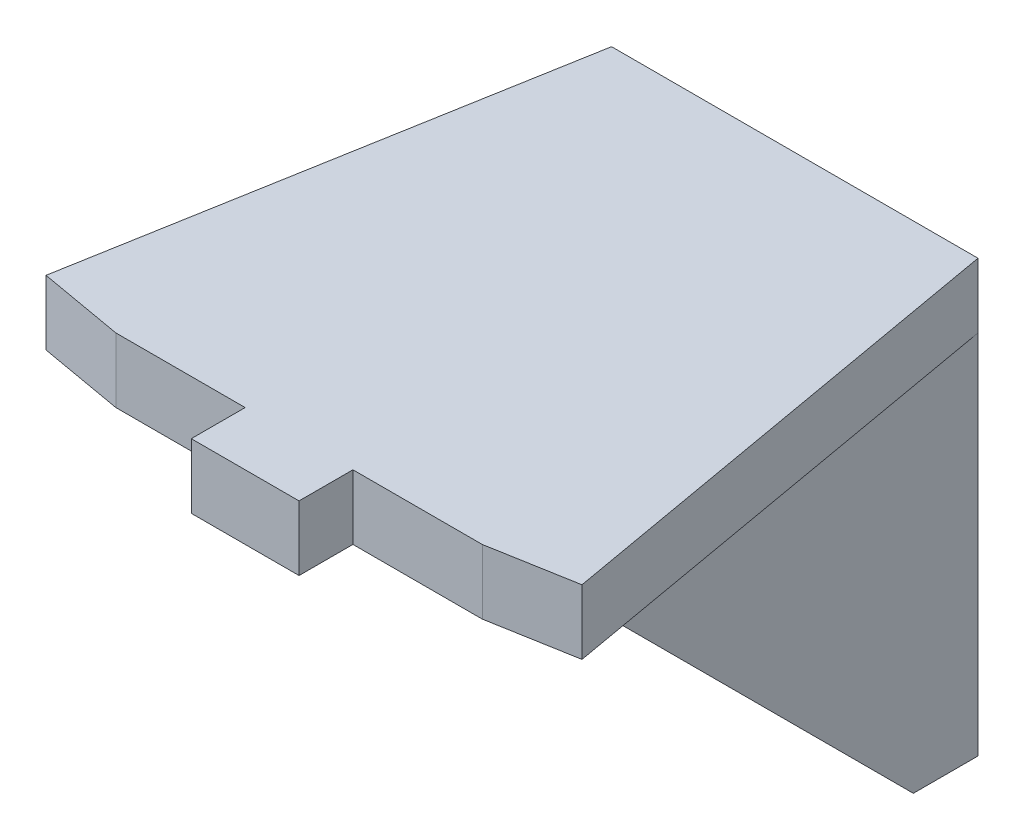
ISO-10303-21;
HEADER;
FILE_DESCRIPTION(('STEP AP214'),'2;1');
FILE_NAME('part.step','',(''),(''),'','','');
FILE_SCHEMA(('AUTOMOTIVE_DESIGN { 1 0 10303 214 1 1 1 1 }'));
ENDSEC;
DATA;
#1=APPLICATION_CONTEXT('core data for automotive mechanical design processes');
#2=APPLICATION_PROTOCOL_DEFINITION('international standard','automotive_design',2000,#1);
#3=PRODUCT_CONTEXT('',#1,'mechanical');
#4=PRODUCT('Part','Part','',(#3));
#5=PRODUCT_RELATED_PRODUCT_CATEGORY('part','',(#4));
#6=PRODUCT_DEFINITION_FORMATION('','',#4);
#7=PRODUCT_DEFINITION_CONTEXT('part definition',#1,'design');
#8=PRODUCT_DEFINITION('design','',#6,#7);
#9=PRODUCT_DEFINITION_SHAPE('','',#8);
#10=(LENGTH_UNIT() NAMED_UNIT(*) SI_UNIT(.MILLI.,.METRE.));
#11=(NAMED_UNIT(*) PLANE_ANGLE_UNIT() SI_UNIT($,.RADIAN.));
#12=(NAMED_UNIT(*) SI_UNIT($,.STERADIAN.) SOLID_ANGLE_UNIT());
#13=UNCERTAINTY_MEASURE_WITH_UNIT(LENGTH_MEASURE(1.E-05),#10,'distance_accuracy_value','');
#14=(GEOMETRIC_REPRESENTATION_CONTEXT(3) GLOBAL_UNCERTAINTY_ASSIGNED_CONTEXT((#13)) GLOBAL_UNIT_ASSIGNED_CONTEXT((#10,
#11,#12)) REPRESENTATION_CONTEXT('',''));
#15=CARTESIAN_POINT('',(0.,0.,0.));
#16=DIRECTION('',(0.,0.,1.));
#17=DIRECTION('',(1.,0.,0.));
#18=AXIS2_PLACEMENT_3D('',#15,#16,#17);
#19=CARTESIAN_POINT('',(8.5,0.,0.));
#20=DIRECTION('',(-1.,0.,0.));
#21=DIRECTION('',(0.,0.,1.));
#22=AXIS2_PLACEMENT_3D('',#19,#20,#21);
#23=PLANE('',#22);
#24=DIRECTION('',(0.,0.,-1.));
#25=VECTOR('',#24,1.);
#26=CARTESIAN_POINT('',(8.5,-3.,23.));
#27=LINE('',#26,#25);
#28=CARTESIAN_POINT('',(8.5,-3.,20.));
#29=VERTEX_POINT('',#28);
#30=CARTESIAN_POINT('',(8.5,-3.,0.));
#31=VERTEX_POINT('',#30);
#32=EDGE_CURVE('E11',#29,#31,#27,.T.);
#33=ORIENTED_EDGE('',*,*,#32,.F.);
#34=DIRECTION('',(0.,-0.707106781186548,-0.707106781186548));
#35=VECTOR('',#34,1.);
#36=CARTESIAN_POINT('',(8.5,-3.,20.));
#37=LINE('',#36,#35);
#38=CARTESIAN_POINT('',(8.5,-20.,2.99999999999999));
#39=VERTEX_POINT('',#38);
#40=EDGE_CURVE('E302',#29,#39,#37,.T.);
#41=ORIENTED_EDGE('',*,*,#40,.T.);
#42=DIRECTION('',(0.,0.,-1.));
#43=VECTOR('',#42,1.);
#44=CARTESIAN_POINT('',(8.5,-20.,0.));
#45=LINE('',#44,#43);
#46=CARTESIAN_POINT('',(8.5,-20.,0.));
#47=VERTEX_POINT('',#46);
#48=EDGE_CURVE('E305',#39,#47,#45,.T.);
#49=ORIENTED_EDGE('',*,*,#48,.T.);
#50=DIRECTION('',(0.,1.,0.));
#51=VECTOR('',#50,1.);
#52=CARTESIAN_POINT('',(8.5,0.,0.));
#53=LINE('',#52,#51);
#54=EDGE_CURVE('E300',#47,#31,#53,.T.);
#55=ORIENTED_EDGE('',*,*,#54,.T.);
#56=EDGE_LOOP('',(#33,#41,#49,#55));
#57=FACE_BOUND('',#56,.T.);
#58=ADVANCED_FACE('F35',(#57),#23,.F.);
#59=CARTESIAN_POINT('',(0.,0.,23.));
#60=DIRECTION('',(0.,0.,1.));
#61=DIRECTION('',(1.,0.,0.));
#62=AXIS2_PLACEMENT_3D('',#59,#60,#61);
#63=PLANE('',#62);
#64=DIRECTION('',(0.,-1.,0.));
#65=VECTOR('',#64,1.);
#66=CARTESIAN_POINT('',(-2.5,0.,23.));
#67=LINE('',#66,#65);
#68=CARTESIAN_POINT('',(-2.5,0.,23.));
#69=VERTEX_POINT('',#68);
#70=CARTESIAN_POINT('',(-2.5,-3.,23.));
#71=VERTEX_POINT('',#70);
#72=EDGE_CURVE('E53',#69,#71,#67,.T.);
#73=ORIENTED_EDGE('',*,*,#72,.F.);
#74=DIRECTION('',(-1.,0.,0.));
#75=VECTOR('',#74,1.);
#76=CARTESIAN_POINT('',(8.5,0.,23.));
#77=LINE('',#76,#75);
#78=CARTESIAN_POINT('',(-8.5,0.,23.));
#79=VERTEX_POINT('',#78);
#80=EDGE_CURVE('E253',#69,#79,#77,.T.);
#81=ORIENTED_EDGE('',*,*,#80,.T.);
#82=DIRECTION('',(0.,-1.,0.));
#83=VECTOR('',#82,1.);
#84=CARTESIAN_POINT('',(-8.5,0.,23.));
#85=LINE('',#84,#83);
#86=CARTESIAN_POINT('',(-8.5,-3.,23.));
#87=VERTEX_POINT('',#86);
#88=EDGE_CURVE('E244',#79,#87,#85,.T.);
#89=ORIENTED_EDGE('',*,*,#88,.T.);
#90=DIRECTION('',(1.,0.,0.));
#91=VECTOR('',#90,1.);
#92=CARTESIAN_POINT('',(-8.5,-3.,23.));
#93=LINE('',#92,#91);
#94=EDGE_CURVE('E250',#87,#71,#93,.T.);
#95=ORIENTED_EDGE('',*,*,#94,.T.);
#96=EDGE_LOOP('',(#73,#81,#89,#95));
#97=FACE_BOUND('',#96,.T.);
#98=ADVANCED_FACE('F381',(#97),#63,.T.);
#99=CARTESIAN_POINT('',(-8.5,0.,0.));
#100=DIRECTION('',(-1.,0.,0.));
#101=DIRECTION('',(0.,0.,1.));
#102=AXIS2_PLACEMENT_3D('',#99,#100,#101);
#103=PLANE('',#102);
#104=DIRECTION('',(0.,-0.707106781186547,-0.707106781186548));
#105=VECTOR('',#104,1.);
#106=CARTESIAN_POINT('',(-8.5,-20.,2.99999999999999));
#107=LINE('',#106,#105);
#108=CARTESIAN_POINT('',(-8.5,-3.,20.));
#109=VERTEX_POINT('',#108);
#110=CARTESIAN_POINT('',(-8.5,-20.,2.99999999999999));
#111=VERTEX_POINT('',#110);
#112=EDGE_CURVE('E310',#109,#111,#107,.T.);
#113=ORIENTED_EDGE('',*,*,#112,.F.);
#114=DIRECTION('',(0.,0.,-1.));
#115=VECTOR('',#114,1.);
#116=CARTESIAN_POINT('',(-8.5,-3.,23.));
#117=LINE('',#116,#115);
#118=CARTESIAN_POINT('',(-8.5,-3.,0.));
#119=VERTEX_POINT('',#118);
#120=EDGE_CURVE('E45',#109,#119,#117,.T.);
#121=ORIENTED_EDGE('',*,*,#120,.T.);
#122=DIRECTION('',(0.,1.,0.));
#123=VECTOR('',#122,1.);
#124=CARTESIAN_POINT('',(-8.5,0.,0.));
#125=LINE('',#124,#123);
#126=CARTESIAN_POINT('',(-8.5,-20.,0.));
#127=VERTEX_POINT('',#126);
#128=EDGE_CURVE('E297',#127,#119,#125,.T.);
#129=ORIENTED_EDGE('',*,*,#128,.F.);
#130=DIRECTION('',(0.,0.,-1.));
#131=VECTOR('',#130,1.);
#132=CARTESIAN_POINT('',(-8.5,-20.,0.));
#133=LINE('',#132,#131);
#134=EDGE_CURVE('E303',#111,#127,#133,.T.);
#135=ORIENTED_EDGE('',*,*,#134,.F.);
#136=EDGE_LOOP('',(#113,#121,#129,#135));
#137=FACE_BOUND('',#136,.T.);
#138=ADVANCED_FACE('F390',(#137),#103,.T.);
#139=CARTESIAN_POINT('',(8.5,-20.,2.99999999999999));
#140=DIRECTION('',(0.,0.707106781186548,-0.707106781186547));
#141=DIRECTION('',(0.,0.707106781186547,0.707106781186548));
#142=AXIS2_PLACEMENT_3D('',#139,#140,#141);
#143=PLANE('',#142);
#144=DIRECTION('',(0.,0.707106781186547,0.707106781186548));
#145=VECTOR('',#144,1.);
#146=CARTESIAN_POINT('',(6.,-20.,2.99999999999999));
#147=LINE('',#146,#145);
#148=CARTESIAN_POINT('',(6.,-20.,2.99999999999999));
#149=VERTEX_POINT('',#148);
#150=CARTESIAN_POINT('',(6.,-3.,20.));
#151=VERTEX_POINT('',#150);
#152=EDGE_CURVE('E335',#149,#151,#147,.T.);
#153=ORIENTED_EDGE('',*,*,#152,.F.);
#154=DIRECTION('',(-1.,0.,0.));
#155=VECTOR('',#154,1.);
#156=CARTESIAN_POINT('',(8.5,-20.,2.99999999999999));
#157=LINE('',#156,#155);
#158=EDGE_CURVE('E317',#39,#149,#157,.T.);
#159=ORIENTED_EDGE('',*,*,#158,.F.);
#160=ORIENTED_EDGE('',*,*,#40,.F.);
#161=DIRECTION('',(-1.,0.,0.));
#162=VECTOR('',#161,1.);
#163=CARTESIAN_POINT('',(8.5,-3.,20.));
#164=LINE('',#163,#162);
#165=EDGE_CURVE('E325',#29,#151,#164,.T.);
#166=ORIENTED_EDGE('',*,*,#165,.T.);
#167=EDGE_LOOP('',(#153,#159,#160,#166));
#168=FACE_BOUND('',#167,.T.);
#169=ADVANCED_FACE('F352',(#168),#143,.F.);
#170=CARTESIAN_POINT('',(8.5,0.,0.));
#171=DIRECTION('',(0.,0.,1.));
#172=DIRECTION('',(0.,-1.,0.));
#173=AXIS2_PLACEMENT_3D('',#170,#171,#172);
#174=PLANE('',#173);
#175=DIRECTION('',(0.,-1.,0.));
#176=VECTOR('',#175,1.);
#177=CARTESIAN_POINT('',(3.,-9.00000000000001,0.));
#178=LINE('',#177,#176);
#179=CARTESIAN_POINT('',(3.,-9.00000000000001,0.));
#180=VERTEX_POINT('',#179);
#181=CARTESIAN_POINT('',(3.,-12.,0.));
#182=VERTEX_POINT('',#181);
#183=EDGE_CURVE('E258',#180,#182,#178,.T.);
#184=ORIENTED_EDGE('',*,*,#183,.F.);
#185=CARTESIAN_POINT('',(0.,-9.00000000000001,0.));
#186=DIRECTION('',(0.,0.,1.));
#187=DIRECTION('',(0.,-1.,0.));
#188=AXIS2_PLACEMENT_3D('',#185,#186,#187);
#189=CIRCLE('',#188,3.);
#190=CARTESIAN_POINT('',(-3.,-9.00000000000001,0.));
#191=VERTEX_POINT('',#190);
#192=EDGE_CURVE('E261',#191,#180,#189,.F.);
#193=ORIENTED_EDGE('',*,*,#192,.F.);
#194=DIRECTION('',(0.,1.,0.));
#195=VECTOR('',#194,1.);
#196=CARTESIAN_POINT('',(-3.,-9.00000000000001,0.));
#197=LINE('',#196,#195);
#198=CARTESIAN_POINT('',(-3.,-12.,0.));
#199=VERTEX_POINT('',#198);
#200=EDGE_CURVE('E278',#199,#191,#197,.T.);
#201=ORIENTED_EDGE('',*,*,#200,.F.);
#202=CARTESIAN_POINT('',(0.,-12.,0.));
#203=DIRECTION('',(0.,0.,1.));
#204=DIRECTION('',(0.,-1.,0.));
#205=AXIS2_PLACEMENT_3D('',#202,#203,#204);
#206=CIRCLE('',#205,3.);
#207=EDGE_CURVE('E256',#182,#199,#206,.F.);
#208=ORIENTED_EDGE('',*,*,#207,.F.);
#209=EDGE_LOOP('',(#184,#193,#201,#208));
#210=FACE_BOUND('',#209,.T.);
#211=ORIENTED_EDGE('',*,*,#128,.T.);
#212=DIRECTION('',(0.,1.,0.));
#213=VECTOR('',#212,1.);
#214=CARTESIAN_POINT('',(-8.5,-3.,0.));
#215=LINE('',#214,#213);
#216=CARTESIAN_POINT('',(-8.5,0.,0.));
#217=VERTEX_POINT('',#216);
#218=EDGE_CURVE('E237',#119,#217,#215,.T.);
#219=ORIENTED_EDGE('',*,*,#218,.T.);
#220=DIRECTION('',(-1.,0.,0.));
#221=VECTOR('',#220,1.);
#222=CARTESIAN_POINT('',(8.5,0.,0.));
#223=LINE('',#222,#221);
#224=CARTESIAN_POINT('',(8.5,0.,0.));
#225=VERTEX_POINT('',#224);
#226=EDGE_CURVE('E321',#225,#217,#223,.T.);
#227=ORIENTED_EDGE('',*,*,#226,.F.);
#228=DIRECTION('',(0.,1.,0.));
#229=VECTOR('',#228,1.);
#230=CARTESIAN_POINT('',(8.5,-3.,0.));
#231=LINE('',#230,#229);
#232=EDGE_CURVE('E194',#31,#225,#231,.T.);
#233=ORIENTED_EDGE('',*,*,#232,.F.);
#234=ORIENTED_EDGE('',*,*,#54,.F.);
#235=DIRECTION('',(-1.,0.,0.));
#236=VECTOR('',#235,1.);
#237=CARTESIAN_POINT('',(8.5,-20.,0.));
#238=LINE('',#237,#236);
#239=EDGE_CURVE('E307',#47,#127,#238,.T.);
#240=ORIENTED_EDGE('',*,*,#239,.T.);
#241=EDGE_LOOP('',(#211,#219,#227,#233,#234,#240));
#242=FACE_BOUND('',#241,.T.);
#243=ADVANCED_FACE('F37',(#210,#242),#174,.F.);
#244=CARTESIAN_POINT('',(8.5,0.,0.));
#245=DIRECTION('',(0.,-1.,0.));
#246=DIRECTION('',(0.,0.,-1.));
#247=AXIS2_PLACEMENT_3D('',#244,#245,#246);
#248=PLANE('',#247);
#249=ORIENTED_EDGE('',*,*,#226,.T.);
#250=DIRECTION('',(-0.173648177666923,0.,0.984807753012209));
#251=VECTOR('',#250,1.);
#252=CARTESIAN_POINT('',(-8.5,0.,0.));
#253=LINE('',#252,#251);
#254=CARTESIAN_POINT('',(-12.433231648245,0.,22.306465139038));
#255=VERTEX_POINT('',#254);
#256=EDGE_CURVE('E227',#217,#255,#253,.T.);
#257=ORIENTED_EDGE('',*,*,#256,.T.);
#258=DIRECTION('',(0.984807753012209,0.,0.173648177666923));
#259=VECTOR('',#258,1.);
#260=CARTESIAN_POINT('',(-8.5,0.,23.));
#261=LINE('',#260,#259);
#262=EDGE_CURVE('E235',#255,#79,#261,.T.);
#263=ORIENTED_EDGE('',*,*,#262,.T.);
#264=ORIENTED_EDGE('',*,*,#80,.F.);
#265=DIRECTION('',(0.,0.,-1.));
#266=VECTOR('',#265,1.);
#267=CARTESIAN_POINT('',(-2.5,0.,25.5));
#268=LINE('',#267,#266);
#269=CARTESIAN_POINT('',(-2.5,0.,25.5));
#270=VERTEX_POINT('',#269);
#271=EDGE_CURVE('E213',#270,#69,#268,.T.);
#272=ORIENTED_EDGE('',*,*,#271,.F.);
#273=DIRECTION('',(-1.,0.,0.));
#274=VECTOR('',#273,1.);
#275=CARTESIAN_POINT('',(-2.5,0.,25.5));
#276=LINE('',#275,#274);
#277=CARTESIAN_POINT('',(2.5,0.,25.5));
#278=VERTEX_POINT('',#277);
#279=EDGE_CURVE('E211',#278,#270,#276,.T.);
#280=ORIENTED_EDGE('',*,*,#279,.F.);
#281=DIRECTION('',(0.,0.,-1.));
#282=VECTOR('',#281,1.);
#283=CARTESIAN_POINT('',(2.5,0.,25.5));
#284=LINE('',#283,#282);
#285=CARTESIAN_POINT('',(2.5,0.,23.));
#286=VERTEX_POINT('',#285);
#287=EDGE_CURVE('E218',#278,#286,#284,.T.);
#288=ORIENTED_EDGE('',*,*,#287,.T.);
#289=CARTESIAN_POINT('',(8.5,0.,23.));
#290=VERTEX_POINT('',#289);
#291=EDGE_CURVE('E254',#290,#286,#77,.T.);
#292=ORIENTED_EDGE('',*,*,#291,.F.);
#293=DIRECTION('',(-0.984807753012209,0.,0.173648177666923));
#294=VECTOR('',#293,1.);
#295=CARTESIAN_POINT('',(8.5,0.,23.));
#296=LINE('',#295,#294);
#297=CARTESIAN_POINT('',(12.433231648245,0.,22.306465139038));
#298=VERTEX_POINT('',#297);
#299=EDGE_CURVE('E199',#298,#290,#296,.T.);
#300=ORIENTED_EDGE('',*,*,#299,.F.);
#301=DIRECTION('',(0.173648177666923,0.,0.984807753012209));
#302=VECTOR('',#301,1.);
#303=CARTESIAN_POINT('',(8.5,0.,0.));
#304=LINE('',#303,#302);
#305=EDGE_CURVE('E190',#225,#298,#304,.T.);
#306=ORIENTED_EDGE('',*,*,#305,.F.);
#307=EDGE_LOOP('',(#249,#257,#263,#264,#272,#280,#288,#292,#300,#306));
#308=FACE_BOUND('',#307,.T.);
#309=ADVANCED_FACE('F362',(#308),#248,.F.);
#310=CARTESIAN_POINT('',(-6.,-20.,2.99999999999999));
#311=VERTEX_POINT('',#310);
#312=EDGE_CURVE('E316',#311,#111,#157,.T.);
#313=ORIENTED_EDGE('',*,*,#312,.F.);
#314=DIRECTION('',(0.,0.707106781186547,0.707106781186548));
#315=VECTOR('',#314,1.);
#316=CARTESIAN_POINT('',(-6.,-20.,2.99999999999999));
#317=LINE('',#316,#315);
#318=CARTESIAN_POINT('',(-6.,-3.,20.));
#319=VERTEX_POINT('',#318);
#320=EDGE_CURVE('E230',#311,#319,#317,.T.);
#321=ORIENTED_EDGE('',*,*,#320,.T.);
#322=EDGE_CURVE('E39',#319,#109,#164,.T.);
#323=ORIENTED_EDGE('',*,*,#322,.T.);
#324=ORIENTED_EDGE('',*,*,#112,.T.);
#325=EDGE_LOOP('',(#313,#321,#323,#324));
#326=FACE_BOUND('',#325,.T.);
#327=ADVANCED_FACE('F395',(#326),#143,.F.);
#328=CARTESIAN_POINT('',(8.5,-20.,0.));
#329=DIRECTION('',(0.,1.,0.));
#330=DIRECTION('',(0.,0.,1.));
#331=AXIS2_PLACEMENT_3D('',#328,#329,#330);
#332=PLANE('',#331);
#333=ORIENTED_EDGE('',*,*,#134,.T.);
#334=ORIENTED_EDGE('',*,*,#239,.F.);
#335=ORIENTED_EDGE('',*,*,#48,.F.);
#336=ORIENTED_EDGE('',*,*,#158,.T.);
#337=DIRECTION('',(1.,0.,0.));
#338=VECTOR('',#337,1.);
#339=CARTESIAN_POINT('',(-6.,-20.,2.99999999999999));
#340=LINE('',#339,#338);
#341=EDGE_CURVE('E295',#311,#149,#340,.T.);
#342=ORIENTED_EDGE('',*,*,#341,.F.);
#343=ORIENTED_EDGE('',*,*,#312,.T.);
#344=EDGE_LOOP('',(#333,#334,#335,#336,#342,#343));
#345=FACE_BOUND('',#344,.T.);
#346=ADVANCED_FACE('F393',(#345),#332,.F.);
#347=CARTESIAN_POINT('',(-6.,0.,0.));
#348=DIRECTION('',(-1.,0.,0.));
#349=DIRECTION('',(0.,0.,1.));
#350=AXIS2_PLACEMENT_3D('',#347,#348,#349);
#351=PLANE('',#350);
#352=DIRECTION('',(0.,1.,0.));
#353=VECTOR('',#352,1.);
#354=CARTESIAN_POINT('',(-6.,-3.,2.99999999999999));
#355=LINE('',#354,#353);
#356=CARTESIAN_POINT('',(-6.,-3.,2.99999999999999));
#357=VERTEX_POINT('',#356);
#358=EDGE_CURVE('E288',#311,#357,#355,.T.);
#359=ORIENTED_EDGE('',*,*,#358,.T.);
#360=DIRECTION('',(0.,0.,1.));
#361=VECTOR('',#360,1.);
#362=CARTESIAN_POINT('',(-6.,-3.,2.99999999999999));
#363=LINE('',#362,#361);
#364=EDGE_CURVE('E291',#357,#319,#363,.T.);
#365=ORIENTED_EDGE('',*,*,#364,.T.);
#366=ORIENTED_EDGE('',*,*,#320,.F.);
#367=EDGE_LOOP('',(#359,#365,#366));
#368=FACE_BOUND('',#367,.T.);
#369=ADVANCED_FACE('F397',(#368),#351,.F.);
#370=CARTESIAN_POINT('',(6.,0.,0.));
#371=DIRECTION('',(-1.,0.,0.));
#372=DIRECTION('',(0.,0.,1.));
#373=AXIS2_PLACEMENT_3D('',#370,#371,#372);
#374=PLANE('',#373);
#375=ORIENTED_EDGE('',*,*,#152,.T.);
#376=DIRECTION('',(0.,0.,1.));
#377=VECTOR('',#376,1.);
#378=CARTESIAN_POINT('',(6.,-3.,2.99999999999999));
#379=LINE('',#378,#377);
#380=CARTESIAN_POINT('',(6.,-3.,2.99999999999999));
#381=VERTEX_POINT('',#380);
#382=EDGE_CURVE('E292',#381,#151,#379,.T.);
#383=ORIENTED_EDGE('',*,*,#382,.F.);
#384=DIRECTION('',(0.,1.,0.));
#385=VECTOR('',#384,1.);
#386=CARTESIAN_POINT('',(6.,-3.,2.99999999999999));
#387=LINE('',#386,#385);
#388=EDGE_CURVE('E287',#149,#381,#387,.T.);
#389=ORIENTED_EDGE('',*,*,#388,.F.);
#390=EDGE_LOOP('',(#375,#383,#389));
#391=FACE_BOUND('',#390,.T.);
#392=ADVANCED_FACE('F400',(#391),#374,.T.);
#393=CARTESIAN_POINT('',(-6.,-3.,2.99999999999999));
#394=DIRECTION('',(0.,0.,-1.));
#395=DIRECTION('',(0.,1.,0.));
#396=AXIS2_PLACEMENT_3D('',#393,#394,#395);
#397=PLANE('',#396);
#398=DIRECTION('',(0.,-1.,0.));
#399=VECTOR('',#398,1.);
#400=CARTESIAN_POINT('',(-3.,-9.00000000000001,2.99999999999999));
#401=LINE('',#400,#399);
#402=CARTESIAN_POINT('',(-3.,-9.00000000000001,2.99999999999999));
#403=VERTEX_POINT('',#402);
#404=CARTESIAN_POINT('',(-3.,-12.,2.99999999999999));
#405=VERTEX_POINT('',#404);
#406=EDGE_CURVE('E266',#403,#405,#401,.T.);
#407=ORIENTED_EDGE('',*,*,#406,.F.);
#408=CARTESIAN_POINT('',(0.,-9.00000000000001,2.99999999999999));
#409=DIRECTION('',(0.,0.,1.));
#410=DIRECTION('',(-1.,0.,0.));
#411=AXIS2_PLACEMENT_3D('',#408,#409,#410);
#412=CIRCLE('',#411,3.);
#413=CARTESIAN_POINT('',(3.,-9.00000000000001,2.99999999999999));
#414=VERTEX_POINT('',#413);
#415=EDGE_CURVE('E264',#414,#403,#412,.T.);
#416=ORIENTED_EDGE('',*,*,#415,.F.);
#417=DIRECTION('',(0.,1.,0.));
#418=VECTOR('',#417,1.);
#419=CARTESIAN_POINT('',(3.,-9.00000000000001,2.99999999999999));
#420=LINE('',#419,#418);
#421=CARTESIAN_POINT('',(3.,-12.,2.99999999999999));
#422=VERTEX_POINT('',#421);
#423=EDGE_CURVE('E272',#422,#414,#420,.T.);
#424=ORIENTED_EDGE('',*,*,#423,.F.);
#425=CARTESIAN_POINT('',(0.,-12.,2.99999999999999));
#426=DIRECTION('',(0.,0.,1.));
#427=DIRECTION('',(1.,0.,0.));
#428=AXIS2_PLACEMENT_3D('',#425,#426,#427);
#429=CIRCLE('',#428,3.);
#430=EDGE_CURVE('E269',#405,#422,#429,.T.);
#431=ORIENTED_EDGE('',*,*,#430,.F.);
#432=EDGE_LOOP('',(#407,#416,#424,#431));
#433=FACE_BOUND('',#432,.T.);
#434=ORIENTED_EDGE('',*,*,#388,.T.);
#435=DIRECTION('',(1.,0.,0.));
#436=VECTOR('',#435,1.);
#437=CARTESIAN_POINT('',(-6.,-3.,2.99999999999999));
#438=LINE('',#437,#436);
#439=EDGE_CURVE('E298',#357,#381,#438,.T.);
#440=ORIENTED_EDGE('',*,*,#439,.F.);
#441=ORIENTED_EDGE('',*,*,#358,.F.);
#442=ORIENTED_EDGE('',*,*,#341,.T.);
#443=EDGE_LOOP('',(#434,#440,#441,#442));
#444=FACE_BOUND('',#443,.T.);
#445=ADVANCED_FACE('F399',(#433,#444),#397,.F.);
#446=CARTESIAN_POINT('',(-6.,-3.,2.99999999999999));
#447=DIRECTION('',(0.,1.,0.));
#448=DIRECTION('',(0.,0.,1.));
#449=AXIS2_PLACEMENT_3D('',#446,#447,#448);
#450=PLANE('',#449);
#451=ORIENTED_EDGE('',*,*,#382,.T.);
#452=ORIENTED_EDGE('',*,*,#165,.F.);
#453=ORIENTED_EDGE('',*,*,#32,.T.);
#454=DIRECTION('',(0.173648177666923,0.,0.984807753012209));
#455=VECTOR('',#454,1.);
#456=CARTESIAN_POINT('',(8.5,-3.,0.));
#457=LINE('',#456,#455);
#458=CARTESIAN_POINT('',(12.433231648245,-3.,22.306465139038));
#459=VERTEX_POINT('',#458);
#460=EDGE_CURVE('E175',#31,#459,#457,.T.);
#461=ORIENTED_EDGE('',*,*,#460,.T.);
#462=DIRECTION('',(-0.984807753012209,0.,0.173648177666923));
#463=VECTOR('',#462,1.);
#464=CARTESIAN_POINT('',(8.5,-3.,23.));
#465=LINE('',#464,#463);
#466=CARTESIAN_POINT('',(8.5,-3.,23.));
#467=VERTEX_POINT('',#466);
#468=EDGE_CURVE('E180',#459,#467,#465,.T.);
#469=ORIENTED_EDGE('',*,*,#468,.T.);
#470=CARTESIAN_POINT('',(2.5,-3.,23.));
#471=VERTEX_POINT('',#470);
#472=EDGE_CURVE('E249',#471,#467,#93,.T.);
#473=ORIENTED_EDGE('',*,*,#472,.F.);
#474=DIRECTION('',(0.,0.,-1.));
#475=VECTOR('',#474,1.);
#476=CARTESIAN_POINT('',(2.5,-3.,25.5));
#477=LINE('',#476,#475);
#478=CARTESIAN_POINT('',(2.5,-3.,25.5));
#479=VERTEX_POINT('',#478);
#480=EDGE_CURVE('E221',#479,#471,#477,.T.);
#481=ORIENTED_EDGE('',*,*,#480,.F.);
#482=DIRECTION('',(1.,0.,0.));
#483=VECTOR('',#482,1.);
#484=CARTESIAN_POINT('',(-2.5,-3.,25.5));
#485=LINE('',#484,#483);
#486=CARTESIAN_POINT('',(-2.5,-3.,25.5));
#487=VERTEX_POINT('',#486);
#488=EDGE_CURVE('E207',#487,#479,#485,.T.);
#489=ORIENTED_EDGE('',*,*,#488,.F.);
#490=DIRECTION('',(0.,0.,-1.));
#491=VECTOR('',#490,1.);
#492=CARTESIAN_POINT('',(-2.5,-3.,25.5));
#493=LINE('',#492,#491);
#494=EDGE_CURVE('E224',#487,#71,#493,.T.);
#495=ORIENTED_EDGE('',*,*,#494,.T.);
#496=ORIENTED_EDGE('',*,*,#94,.F.);
#497=DIRECTION('',(0.984807753012209,0.,0.173648177666923));
#498=VECTOR('',#497,1.);
#499=CARTESIAN_POINT('',(-8.5,-3.,23.));
#500=LINE('',#499,#498);
#501=CARTESIAN_POINT('',(-12.433231648245,-3.,22.306465139038));
#502=VERTEX_POINT('',#501);
#503=EDGE_CURVE('E234',#502,#87,#500,.T.);
#504=ORIENTED_EDGE('',*,*,#503,.F.);
#505=DIRECTION('',(-0.173648177666923,0.,0.984807753012209));
#506=VECTOR('',#505,1.);
#507=CARTESIAN_POINT('',(-8.5,-3.,0.));
#508=LINE('',#507,#506);
#509=EDGE_CURVE('E231',#119,#502,#508,.T.);
#510=ORIENTED_EDGE('',*,*,#509,.F.);
#511=ORIENTED_EDGE('',*,*,#120,.F.);
#512=ORIENTED_EDGE('',*,*,#322,.F.);
#513=ORIENTED_EDGE('',*,*,#364,.F.);
#514=ORIENTED_EDGE('',*,*,#439,.T.);
#515=EDGE_LOOP('',(#451,#452,#453,#461,#469,#473,#481,#489,#495,#496,#504,#510,#511,#512,#513,#514));
#516=FACE_BOUND('',#515,.T.);
#517=ADVANCED_FACE('F178',(#516),#450,.F.);
#518=CARTESIAN_POINT('',(0.,-9.00000000000001,-0.00100000000001401));
#519=DIRECTION('',(0.,0.,1.));
#520=DIRECTION('',(1.,0.,0.));
#521=AXIS2_PLACEMENT_3D('',#518,#519,#520);
#522=CYLINDRICAL_SURFACE('',#521,3.);
#523=ORIENTED_EDGE('',*,*,#192,.T.);
#524=DIRECTION('',(0.,0.,1.));
#525=VECTOR('',#524,1.);
#526=CARTESIAN_POINT('',(3.,-9.00000000000001,-0.00100000000001401));
#527=LINE('',#526,#525);
#528=EDGE_CURVE('E276',#180,#414,#527,.T.);
#529=ORIENTED_EDGE('',*,*,#528,.T.);
#530=ORIENTED_EDGE('',*,*,#415,.T.);
#531=DIRECTION('',(0.,0.,1.));
#532=VECTOR('',#531,1.);
#533=CARTESIAN_POINT('',(-3.,-9.00000000000001,-0.00100000000001401));
#534=LINE('',#533,#532);
#535=EDGE_CURVE('E275',#191,#403,#534,.T.);
#536=ORIENTED_EDGE('',*,*,#535,.F.);
#537=EDGE_LOOP('',(#523,#529,#530,#536));
#538=FACE_BOUND('',#537,.T.);
#539=ADVANCED_FACE('F440',(#538),#522,.F.);
#540=CARTESIAN_POINT('',(3.,-9.00000000000001,-0.00100000000001401));
#541=DIRECTION('',(1.,0.,0.));
#542=DIRECTION('',(0.,1.,0.));
#543=AXIS2_PLACEMENT_3D('',#540,#541,#542);
#544=PLANE('',#543);
#545=ORIENTED_EDGE('',*,*,#183,.T.);
#546=DIRECTION('',(0.,0.,1.));
#547=VECTOR('',#546,1.);
#548=CARTESIAN_POINT('',(3.,-12.,-0.00100000000001401));
#549=LINE('',#548,#547);
#550=EDGE_CURVE('E279',#182,#422,#549,.T.);
#551=ORIENTED_EDGE('',*,*,#550,.T.);
#552=ORIENTED_EDGE('',*,*,#423,.T.);
#553=ORIENTED_EDGE('',*,*,#528,.F.);
#554=EDGE_LOOP('',(#545,#551,#552,#553));
#555=FACE_BOUND('',#554,.T.);
#556=ADVANCED_FACE('F436',(#555),#544,.F.);
#557=CARTESIAN_POINT('',(0.,-12.,-0.00100000000001401));
#558=DIRECTION('',(0.,0.,1.));
#559=DIRECTION('',(1.,0.,0.));
#560=AXIS2_PLACEMENT_3D('',#557,#558,#559);
#561=CYLINDRICAL_SURFACE('',#560,3.);
#562=ORIENTED_EDGE('',*,*,#207,.T.);
#563=DIRECTION('',(0.,0.,1.));
#564=VECTOR('',#563,1.);
#565=CARTESIAN_POINT('',(-3.,-12.,-0.00100000000001401));
#566=LINE('',#565,#564);
#567=EDGE_CURVE('E281',#199,#405,#566,.T.);
#568=ORIENTED_EDGE('',*,*,#567,.T.);
#569=ORIENTED_EDGE('',*,*,#430,.T.);
#570=ORIENTED_EDGE('',*,*,#550,.F.);
#571=EDGE_LOOP('',(#562,#568,#569,#570));
#572=FACE_BOUND('',#571,.T.);
#573=ADVANCED_FACE('F447',(#572),#561,.F.);
#574=CARTESIAN_POINT('',(-3.,-9.00000000000001,-0.00100000000001401));
#575=DIRECTION('',(-1.,0.,0.));
#576=DIRECTION('',(0.,-1.,0.));
#577=AXIS2_PLACEMENT_3D('',#574,#575,#576);
#578=PLANE('',#577);
#579=ORIENTED_EDGE('',*,*,#200,.T.);
#580=ORIENTED_EDGE('',*,*,#535,.T.);
#581=ORIENTED_EDGE('',*,*,#406,.T.);
#582=ORIENTED_EDGE('',*,*,#567,.F.);
#583=EDGE_LOOP('',(#579,#580,#581,#582));
#584=FACE_BOUND('',#583,.T.);
#585=ADVANCED_FACE('F444',(#584),#578,.F.);
#586=DIRECTION('',(0.,1.,0.));
#587=VECTOR('',#586,1.);
#588=CARTESIAN_POINT('',(2.5,0.,23.));
#589=LINE('',#588,#587);
#590=EDGE_CURVE('E61',#471,#286,#589,.T.);
#591=ORIENTED_EDGE('',*,*,#590,.F.);
#592=ORIENTED_EDGE('',*,*,#472,.T.);
#593=DIRECTION('',(0.,1.,0.));
#594=VECTOR('',#593,1.);
#595=CARTESIAN_POINT('',(8.5,-3.,23.));
#596=LINE('',#595,#594);
#597=EDGE_CURVE('E197',#467,#290,#596,.T.);
#598=ORIENTED_EDGE('',*,*,#597,.T.);
#599=ORIENTED_EDGE('',*,*,#291,.T.);
#600=EDGE_LOOP('',(#591,#592,#598,#599));
#601=FACE_BOUND('',#600,.T.);
#602=ADVANCED_FACE('F366',(#601),#63,.T.);
#603=CARTESIAN_POINT('',(-8.5,-3.,23.));
#604=DIRECTION('',(-0.173648177666923,0.,0.984807753012209));
#605=DIRECTION('',(0.984807753012209,0.,0.173648177666923));
#606=AXIS2_PLACEMENT_3D('',#603,#604,#605);
#607=PLANE('',#606);
#608=ORIENTED_EDGE('',*,*,#262,.F.);
#609=DIRECTION('',(0.,1.,0.));
#610=VECTOR('',#609,1.);
#611=CARTESIAN_POINT('',(-12.433231648245,-3.,22.306465139038));
#612=LINE('',#611,#610);
#613=EDGE_CURVE('E242',#502,#255,#612,.T.);
#614=ORIENTED_EDGE('',*,*,#613,.F.);
#615=ORIENTED_EDGE('',*,*,#503,.T.);
#616=ORIENTED_EDGE('',*,*,#88,.F.);
#617=EDGE_LOOP('',(#608,#614,#615,#616));
#618=FACE_BOUND('',#617,.T.);
#619=ADVANCED_FACE('F383',(#618),#607,.T.);
#620=CARTESIAN_POINT('',(-8.5,-3.,0.));
#621=DIRECTION('',(-0.984807753012209,0.,-0.173648177666923));
#622=DIRECTION('',(-0.173648177666923,0.,0.984807753012209));
#623=AXIS2_PLACEMENT_3D('',#620,#621,#622);
#624=PLANE('',#623);
#625=ORIENTED_EDGE('',*,*,#256,.F.);
#626=ORIENTED_EDGE('',*,*,#218,.F.);
#627=ORIENTED_EDGE('',*,*,#509,.T.);
#628=ORIENTED_EDGE('',*,*,#613,.T.);
#629=EDGE_LOOP('',(#625,#626,#627,#628));
#630=FACE_BOUND('',#629,.T.);
#631=ADVANCED_FACE('F386',(#630),#624,.T.);
#632=CARTESIAN_POINT('',(-2.5,0.,25.5));
#633=DIRECTION('',(1.,0.,0.));
#634=DIRECTION('',(0.,1.,0.));
#635=AXIS2_PLACEMENT_3D('',#632,#633,#634);
#636=PLANE('',#635);
#637=ORIENTED_EDGE('',*,*,#72,.T.);
#638=ORIENTED_EDGE('',*,*,#494,.F.);
#639=DIRECTION('',(0.,-1.,0.));
#640=VECTOR('',#639,1.);
#641=CARTESIAN_POINT('',(-2.5,0.,25.5));
#642=LINE('',#641,#640);
#643=EDGE_CURVE('E204',#270,#487,#642,.T.);
#644=ORIENTED_EDGE('',*,*,#643,.F.);
#645=ORIENTED_EDGE('',*,*,#271,.T.);
#646=EDGE_LOOP('',(#637,#638,#644,#645));
#647=FACE_BOUND('',#646,.T.);
#648=ADVANCED_FACE('F378',(#647),#636,.F.);
#649=CARTESIAN_POINT('',(2.5,0.,25.5));
#650=DIRECTION('',(-1.,0.,0.));
#651=DIRECTION('',(0.,0.,1.));
#652=AXIS2_PLACEMENT_3D('',#649,#650,#651);
#653=PLANE('',#652);
#654=ORIENTED_EDGE('',*,*,#590,.T.);
#655=ORIENTED_EDGE('',*,*,#287,.F.);
#656=DIRECTION('',(0.,1.,0.));
#657=VECTOR('',#656,1.);
#658=CARTESIAN_POINT('',(2.5,0.,25.5));
#659=LINE('',#658,#657);
#660=EDGE_CURVE('E209',#479,#278,#659,.T.);
#661=ORIENTED_EDGE('',*,*,#660,.F.);
#662=ORIENTED_EDGE('',*,*,#480,.T.);
#663=EDGE_LOOP('',(#654,#655,#661,#662));
#664=FACE_BOUND('',#663,.T.);
#665=ADVANCED_FACE('F368',(#664),#653,.F.);
#666=CARTESIAN_POINT('',(0.,0.,25.5));
#667=DIRECTION('',(0.,0.,1.));
#668=DIRECTION('',(1.,0.,0.));
#669=AXIS2_PLACEMENT_3D('',#666,#667,#668);
#670=PLANE('',#669);
#671=ORIENTED_EDGE('',*,*,#643,.T.);
#672=ORIENTED_EDGE('',*,*,#488,.T.);
#673=ORIENTED_EDGE('',*,*,#660,.T.);
#674=ORIENTED_EDGE('',*,*,#279,.T.);
#675=EDGE_LOOP('',(#671,#672,#673,#674));
#676=FACE_BOUND('',#675,.T.);
#677=ADVANCED_FACE('F375',(#676),#670,.T.);
#678=CARTESIAN_POINT('',(8.5,-3.,0.));
#679=DIRECTION('',(-0.984807753012209,0.,0.173648177666923));
#680=DIRECTION('',(0.173648177666923,0.,0.984807753012209));
#681=AXIS2_PLACEMENT_3D('',#678,#679,#680);
#682=PLANE('',#681);
#683=ORIENTED_EDGE('',*,*,#305,.T.);
#684=DIRECTION('',(0.,1.,0.));
#685=VECTOR('',#684,1.);
#686=CARTESIAN_POINT('',(12.433231648245,-3.,22.306465139038));
#687=LINE('',#686,#685);
#688=EDGE_CURVE('E185',#459,#298,#687,.T.);
#689=ORIENTED_EDGE('',*,*,#688,.F.);
#690=ORIENTED_EDGE('',*,*,#460,.F.);
#691=ORIENTED_EDGE('',*,*,#232,.T.);
#692=EDGE_LOOP('',(#683,#689,#690,#691));
#693=FACE_BOUND('',#692,.T.);
#694=ADVANCED_FACE('F188',(#693),#682,.F.);
#695=CARTESIAN_POINT('',(8.5,-3.,23.));
#696=DIRECTION('',(-0.173648177666923,0.,-0.984807753012209));
#697=DIRECTION('',(-0.984807753012209,0.,0.173648177666923));
#698=AXIS2_PLACEMENT_3D('',#695,#696,#697);
#699=PLANE('',#698);
#700=ORIENTED_EDGE('',*,*,#299,.T.);
#701=ORIENTED_EDGE('',*,*,#597,.F.);
#702=ORIENTED_EDGE('',*,*,#468,.F.);
#703=ORIENTED_EDGE('',*,*,#688,.T.);
#704=EDGE_LOOP('',(#700,#701,#702,#703));
#705=FACE_BOUND('',#704,.T.);
#706=ADVANCED_FACE('F196',(#705),#699,.F.);
#707=CLOSED_SHELL('',(#58,#98,#138,#169,#243,#309,#327,#346,#369,#392,#445,#517,#539,#556,#573,
#585,#602,#619,#631,#648,#665,#677,#694,#706));
#708=MANIFOLD_SOLID_BREP('B2',#707);
#709=ADVANCED_BREP_SHAPE_REPRESENTATION('',(#18,#708),#14);
#710=SHAPE_DEFINITION_REPRESENTATION(#9,#709);
ENDSEC;
END-ISO-10303-21;
